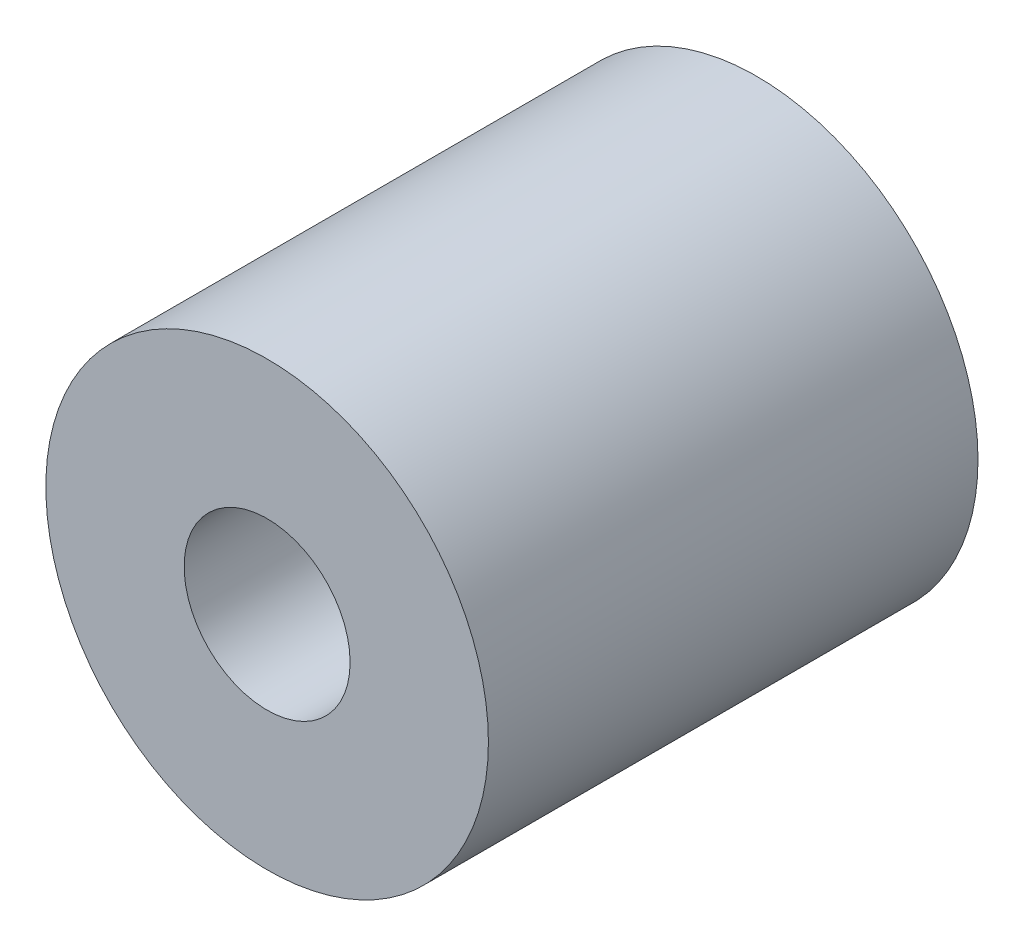
ISO-10303-21;
HEADER;
FILE_DESCRIPTION(('STEP AP214'),'2;1');
FILE_NAME('part.step','',(''),(''),'','','');
FILE_SCHEMA(('AUTOMOTIVE_DESIGN { 1 0 10303 214 1 1 1 1 }'));
ENDSEC;
DATA;
#1=APPLICATION_CONTEXT('core data for automotive mechanical design processes');
#2=APPLICATION_PROTOCOL_DEFINITION('international standard','automotive_design',2000,#1);
#3=PRODUCT_CONTEXT('',#1,'mechanical');
#4=PRODUCT('Part','Part','',(#3));
#5=PRODUCT_RELATED_PRODUCT_CATEGORY('part','',(#4));
#6=PRODUCT_DEFINITION_FORMATION('','',#4);
#7=PRODUCT_DEFINITION_CONTEXT('part definition',#1,'design');
#8=PRODUCT_DEFINITION('design','',#6,#7);
#9=PRODUCT_DEFINITION_SHAPE('','',#8);
#10=(LENGTH_UNIT() NAMED_UNIT(*) SI_UNIT(.MILLI.,.METRE.));
#11=(NAMED_UNIT(*) PLANE_ANGLE_UNIT() SI_UNIT($,.RADIAN.));
#12=(NAMED_UNIT(*) SI_UNIT($,.STERADIAN.) SOLID_ANGLE_UNIT());
#13=UNCERTAINTY_MEASURE_WITH_UNIT(LENGTH_MEASURE(1.E-05),#10,'distance_accuracy_value','');
#14=(GEOMETRIC_REPRESENTATION_CONTEXT(3) GLOBAL_UNCERTAINTY_ASSIGNED_CONTEXT((#13)) GLOBAL_UNIT_ASSIGNED_CONTEXT((#10,
#11,#12)) REPRESENTATION_CONTEXT('',''));
#15=CARTESIAN_POINT('',(0.,0.,0.));
#16=DIRECTION('',(0.,0.,1.));
#17=DIRECTION('',(1.,0.,0.));
#18=AXIS2_PLACEMENT_3D('',#15,#16,#17);
#19=CARTESIAN_POINT('',(0.,0.,0.));
#20=DIRECTION('',(0.,0.,1.));
#21=DIRECTION('',(1.,0.,0.));
#22=AXIS2_PLACEMENT_3D('',#19,#20,#21);
#23=PLANE('',#22);
#24=CARTESIAN_POINT('',(0.,0.,0.));
#25=DIRECTION('',(0.,0.,1.));
#26=DIRECTION('',(1.,0.,0.));
#27=AXIS2_PLACEMENT_3D('',#24,#25,#26);
#28=CIRCLE('',#27,16.);
#29=CARTESIAN_POINT('',(16.,0.,0.));
#30=VERTEX_POINT('',#29);
#31=EDGE_CURVE('E10',#30,#30,#28,.T.);
#32=ORIENTED_EDGE('',*,*,#31,.F.);
#33=EDGE_LOOP('',(#32));
#34=FACE_BOUND('',#33,.T.);
#35=CARTESIAN_POINT('',(0.,0.,0.));
#36=DIRECTION('',(0.,0.,1.));
#37=DIRECTION('',(1.,0.,0.));
#38=AXIS2_PLACEMENT_3D('',#35,#36,#37);
#39=CIRCLE('',#38,11.);
#40=CARTESIAN_POINT('',(11.,0.,0.));
#41=VERTEX_POINT('',#40);
#42=EDGE_CURVE('E43',#41,#41,#39,.T.);
#43=ORIENTED_EDGE('',*,*,#42,.T.);
#44=EDGE_LOOP('',(#43));
#45=FACE_BOUND('',#44,.T.);
#46=ADVANCED_FACE('F36',(#34,#45),#23,.F.);
#47=CARTESIAN_POINT('',(0.,0.,19.));
#48=DIRECTION('',(0.,0.,-1.));
#49=DIRECTION('',(-1.,0.,0.));
#50=AXIS2_PLACEMENT_3D('',#47,#48,#49);
#51=CYLINDRICAL_SURFACE('',#50,16.);
#52=ORIENTED_EDGE('',*,*,#31,.T.);
#53=EDGE_LOOP('',(#52));
#54=FACE_BOUND('',#53,.T.);
#55=CARTESIAN_POINT('',(0.,0.,35.4000000000002));
#56=DIRECTION('',(0.,0.,1.));
#57=DIRECTION('',(1.,0.,0.));
#58=AXIS2_PLACEMENT_3D('',#55,#56,#57);
#59=CIRCLE('',#58,16.);
#60=CARTESIAN_POINT('',(16.,0.,35.4000000000002));
#61=VERTEX_POINT('',#60);
#62=EDGE_CURVE('E51',#61,#61,#59,.T.);
#63=ORIENTED_EDGE('',*,*,#62,.F.);
#64=EDGE_LOOP('',(#63));
#65=FACE_BOUND('',#64,.T.);
#66=ADVANCED_FACE('F38',(#54,#65),#51,.T.);
#67=CARTESIAN_POINT('',(0.,0.,19.));
#68=DIRECTION('',(0.,0.,-1.));
#69=DIRECTION('',(-1.,0.,0.));
#70=AXIS2_PLACEMENT_3D('',#67,#68,#69);
#71=CYLINDRICAL_SURFACE('',#70,11.);
#72=CARTESIAN_POINT('',(0.,0.,19.));
#73=DIRECTION('',(0.,0.,1.));
#74=DIRECTION('',(1.,0.,0.));
#75=AXIS2_PLACEMENT_3D('',#72,#73,#74);
#76=CIRCLE('',#75,11.);
#77=CARTESIAN_POINT('',(11.,0.,19.));
#78=VERTEX_POINT('',#77);
#79=EDGE_CURVE('E47',#78,#78,#76,.T.);
#80=ORIENTED_EDGE('',*,*,#79,.T.);
#81=EDGE_LOOP('',(#80));
#82=FACE_BOUND('',#81,.T.);
#83=ORIENTED_EDGE('',*,*,#42,.F.);
#84=EDGE_LOOP('',(#83));
#85=FACE_BOUND('',#84,.T.);
#86=ADVANCED_FACE('F76',(#82,#85),#71,.F.);
#87=CARTESIAN_POINT('',(0.,0.,19.));
#88=DIRECTION('',(0.,0.,1.));
#89=DIRECTION('',(1.,0.,0.));
#90=AXIS2_PLACEMENT_3D('',#87,#88,#89);
#91=PLANE('',#90);
#92=CARTESIAN_POINT('',(0.,0.,19.));
#93=DIRECTION('',(0.,0.,1.));
#94=DIRECTION('',(1.,0.,0.));
#95=AXIS2_PLACEMENT_3D('',#92,#93,#94);
#96=CIRCLE('',#95,6.);
#97=CARTESIAN_POINT('',(6.00000000000001,0.,19.));
#98=VERTEX_POINT('',#97);
#99=EDGE_CURVE('E57',#98,#98,#96,.T.);
#100=ORIENTED_EDGE('',*,*,#99,.T.);
#101=EDGE_LOOP('',(#100));
#102=FACE_BOUND('',#101,.T.);
#103=ORIENTED_EDGE('',*,*,#79,.F.);
#104=EDGE_LOOP('',(#103));
#105=FACE_BOUND('',#104,.T.);
#106=ADVANCED_FACE('F68',(#102,#105),#91,.F.);
#107=CARTESIAN_POINT('',(0.,0.,35.4000000000002));
#108=DIRECTION('',(0.,0.,1.));
#109=DIRECTION('',(1.,0.,0.));
#110=AXIS2_PLACEMENT_3D('',#107,#108,#109);
#111=PLANE('',#110);
#112=ORIENTED_EDGE('',*,*,#62,.T.);
#113=EDGE_LOOP('',(#112));
#114=FACE_BOUND('',#113,.T.);
#115=CARTESIAN_POINT('',(0.,0.,35.4000000000002));
#116=DIRECTION('',(0.,0.,1.));
#117=DIRECTION('',(1.,0.,0.));
#118=AXIS2_PLACEMENT_3D('',#115,#116,#117);
#119=CIRCLE('',#118,6.);
#120=CARTESIAN_POINT('',(6.00000000000001,0.,35.4000000000002));
#121=VERTEX_POINT('',#120);
#122=EDGE_CURVE('E56',#121,#121,#119,.T.);
#123=ORIENTED_EDGE('',*,*,#122,.F.);
#124=EDGE_LOOP('',(#123));
#125=FACE_BOUND('',#124,.T.);
#126=ADVANCED_FACE('F66',(#114,#125),#111,.T.);
#127=CARTESIAN_POINT('',(0.,0.,35.4000000000002));
#128=DIRECTION('',(0.,0.,-1.));
#129=DIRECTION('',(-1.,0.,0.));
#130=AXIS2_PLACEMENT_3D('',#127,#128,#129);
#131=CYLINDRICAL_SURFACE('',#130,6.);
#132=ORIENTED_EDGE('',*,*,#122,.T.);
#133=EDGE_LOOP('',(#132));
#134=FACE_BOUND('',#133,.T.);
#135=ORIENTED_EDGE('',*,*,#99,.F.);
#136=EDGE_LOOP('',(#135));
#137=FACE_BOUND('',#136,.T.);
#138=ADVANCED_FACE('F63',(#134,#137),#131,.F.);
#139=CLOSED_SHELL('',(#46,#66,#86,#106,#126,#138));
#140=MANIFOLD_SOLID_BREP('B2',#139);
#141=ADVANCED_BREP_SHAPE_REPRESENTATION('',(#18,#140),#14);
#142=SHAPE_DEFINITION_REPRESENTATION(#9,#141);
ENDSEC;
END-ISO-10303-21;
